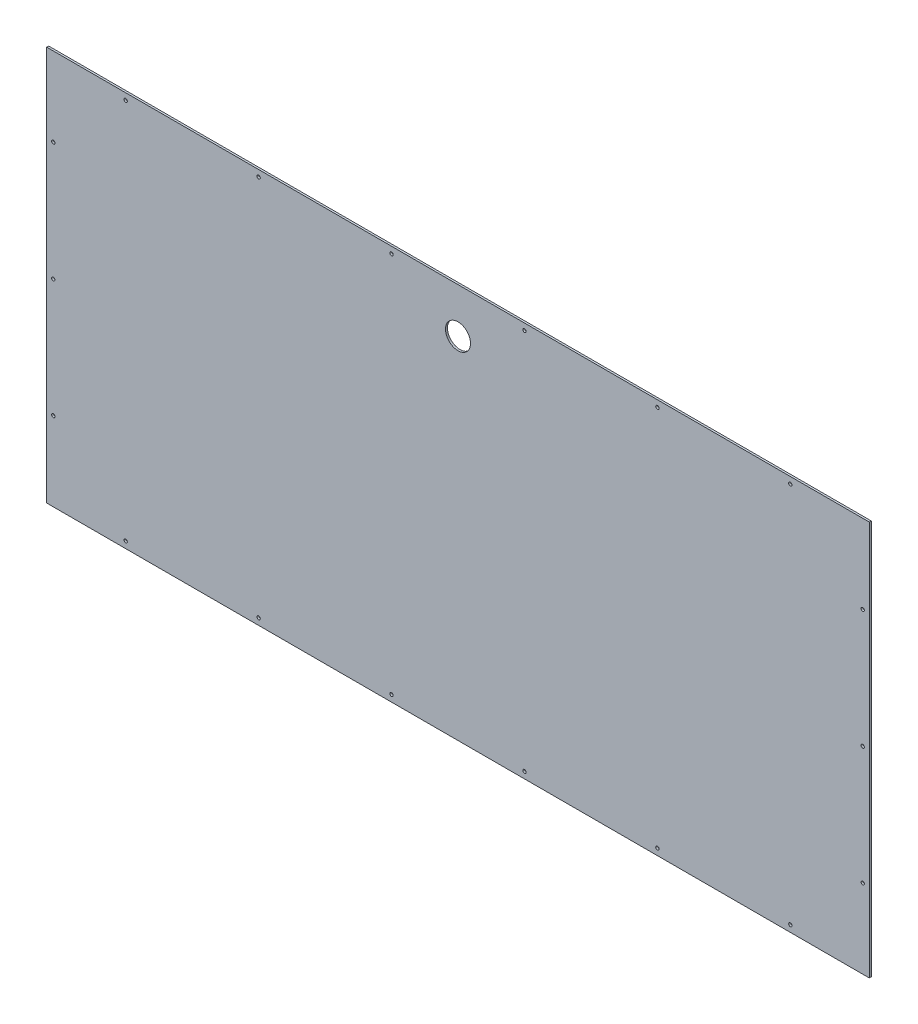
ISO-10303-21;
HEADER;
FILE_DESCRIPTION(('STEP AP214'),'2;1');
FILE_NAME('part.step','',(''),(''),'','','');
FILE_SCHEMA(('AUTOMOTIVE_DESIGN { 1 0 10303 214 1 1 1 1 }'));
ENDSEC;
DATA;
#1=APPLICATION_CONTEXT('core data for automotive mechanical design processes');
#2=APPLICATION_PROTOCOL_DEFINITION('international standard','automotive_design',2000,#1);
#3=PRODUCT_CONTEXT('',#1,'mechanical');
#4=PRODUCT('Part','Part','',(#3));
#5=PRODUCT_RELATED_PRODUCT_CATEGORY('part','',(#4));
#6=PRODUCT_DEFINITION_FORMATION('','',#4);
#7=PRODUCT_DEFINITION_CONTEXT('part definition',#1,'design');
#8=PRODUCT_DEFINITION('design','',#6,#7);
#9=PRODUCT_DEFINITION_SHAPE('','',#8);
#10=(LENGTH_UNIT() NAMED_UNIT(*) SI_UNIT(.MILLI.,.METRE.));
#11=(NAMED_UNIT(*) PLANE_ANGLE_UNIT() SI_UNIT($,.RADIAN.));
#12=(NAMED_UNIT(*) SI_UNIT($,.STERADIAN.) SOLID_ANGLE_UNIT());
#13=UNCERTAINTY_MEASURE_WITH_UNIT(LENGTH_MEASURE(1.E-05),#10,'distance_accuracy_value','');
#14=(GEOMETRIC_REPRESENTATION_CONTEXT(3) GLOBAL_UNCERTAINTY_ASSIGNED_CONTEXT((#13)) GLOBAL_UNIT_ASSIGNED_CONTEXT((#10,
#11,#12)) REPRESENTATION_CONTEXT('',''));
#15=CARTESIAN_POINT('',(0.,0.,0.));
#16=DIRECTION('',(0.,0.,1.));
#17=DIRECTION('',(1.,0.,0.));
#18=AXIS2_PLACEMENT_3D('',#15,#16,#17);
#19=CARTESIAN_POINT('',(0.,0.,3.));
#20=DIRECTION('',(0.,0.,1.));
#21=DIRECTION('',(1.,0.,0.));
#22=AXIS2_PLACEMENT_3D('',#19,#20,#21);
#23=PLANE('',#22);
#24=CARTESIAN_POINT('',(-505.,-290.000000000007,3.));
#25=DIRECTION('',(0.,0.,1.));
#26=DIRECTION('',(1.,0.,0.));
#27=AXIS2_PLACEMENT_3D('',#24,#25,#26);
#28=CIRCLE('',#27,2.55000000000005);
#29=CARTESIAN_POINT('',(-502.45,-290.000000000007,3.));
#30=VERTEX_POINT('',#29);
#31=EDGE_CURVE('E211',#30,#30,#28,.T.);
#32=ORIENTED_EDGE('',*,*,#31,.F.);
#33=EDGE_LOOP('',(#32));
#34=FACE_BOUND('',#33,.T.);
#35=CARTESIAN_POINT('',(615.000000000002,0.,3.));
#36=DIRECTION('',(0.,0.,1.));
#37=DIRECTION('',(1.,0.,0.));
#38=AXIS2_PLACEMENT_3D('',#35,#36,#37);
#39=CIRCLE('',#38,2.55000000000005);
#40=CARTESIAN_POINT('',(617.550000000002,0.,3.));
#41=VERTEX_POINT('',#40);
#42=EDGE_CURVE('E199',#41,#41,#39,.T.);
#43=ORIENTED_EDGE('',*,*,#42,.F.);
#44=EDGE_LOOP('',(#43));
#45=FACE_BOUND('',#44,.T.);
#46=CARTESIAN_POINT('',(-614.999999999997,-180.,3.));
#47=DIRECTION('',(0.,0.,1.));
#48=DIRECTION('',(1.,0.,0.));
#49=AXIS2_PLACEMENT_3D('',#46,#47,#48);
#50=CIRCLE('',#49,2.55000000000005);
#51=CARTESIAN_POINT('',(-612.449999999998,-180.,3.));
#52=VERTEX_POINT('',#51);
#53=EDGE_CURVE('E187',#52,#52,#50,.T.);
#54=ORIENTED_EDGE('',*,*,#53,.F.);
#55=EDGE_LOOP('',(#54));
#56=FACE_BOUND('',#55,.T.);
#57=CARTESIAN_POINT('',(-101.,-290.000000000004,3.));
#58=DIRECTION('',(0.,0.,1.));
#59=DIRECTION('',(1.,0.,0.));
#60=AXIS2_PLACEMENT_3D('',#57,#58,#59);
#61=CIRCLE('',#60,2.55);
#62=CARTESIAN_POINT('',(-98.4500000000002,-290.000000000004,3.));
#63=VERTEX_POINT('',#62);
#64=EDGE_CURVE('E175',#63,#63,#61,.T.);
#65=ORIENTED_EDGE('',*,*,#64,.F.);
#66=EDGE_LOOP('',(#65));
#67=FACE_BOUND('',#66,.T.);
#68=CARTESIAN_POINT('',(615.,180.,3.));
#69=DIRECTION('',(0.,0.,1.));
#70=DIRECTION('',(1.,0.,0.));
#71=AXIS2_PLACEMENT_3D('',#68,#69,#70);
#72=CIRCLE('',#71,2.55000000000005);
#73=CARTESIAN_POINT('',(617.55,180.,3.));
#74=VERTEX_POINT('',#73);
#75=EDGE_CURVE('E163',#74,#74,#72,.T.);
#76=ORIENTED_EDGE('',*,*,#75,.F.);
#77=EDGE_LOOP('',(#76));
#78=FACE_BOUND('',#77,.T.);
#79=CARTESIAN_POINT('',(303.,-290.000000000001,3.));
#80=DIRECTION('',(0.,0.,1.));
#81=DIRECTION('',(1.,0.,0.));
#82=AXIS2_PLACEMENT_3D('',#79,#80,#81);
#83=CIRCLE('',#82,2.55);
#84=CARTESIAN_POINT('',(305.55,-290.000000000001,3.));
#85=VERTEX_POINT('',#84);
#86=EDGE_CURVE('E151',#85,#85,#83,.T.);
#87=ORIENTED_EDGE('',*,*,#86,.F.);
#88=EDGE_LOOP('',(#87));
#89=FACE_BOUND('',#88,.T.);
#90=CARTESIAN_POINT('',(-303.,289.999999999995,3.));
#91=DIRECTION('',(0.,0.,1.));
#92=DIRECTION('',(1.,0.,0.));
#93=AXIS2_PLACEMENT_3D('',#90,#91,#92);
#94=CIRCLE('',#93,2.55);
#95=CARTESIAN_POINT('',(-300.45,289.999999999995,3.));
#96=VERTEX_POINT('',#95);
#97=EDGE_CURVE('E139',#96,#96,#94,.T.);
#98=ORIENTED_EDGE('',*,*,#97,.F.);
#99=EDGE_LOOP('',(#98));
#100=FACE_BOUND('',#99,.T.);
#101=CARTESIAN_POINT('',(505.,290.,3.));
#102=DIRECTION('',(0.,0.,1.));
#103=DIRECTION('',(1.,0.,0.));
#104=AXIS2_PLACEMENT_3D('',#101,#102,#103);
#105=CIRCLE('',#104,2.55000000000005);
#106=CARTESIAN_POINT('',(507.55,290.,3.));
#107=VERTEX_POINT('',#106);
#108=EDGE_CURVE('E127',#107,#107,#105,.T.);
#109=ORIENTED_EDGE('',*,*,#108,.F.);
#110=EDGE_LOOP('',(#109));
#111=FACE_BOUND('',#110,.T.);
#112=CARTESIAN_POINT('',(303.,289.999999999999,3.));
#113=DIRECTION('',(0.,0.,1.));
#114=DIRECTION('',(1.,0.,0.));
#115=AXIS2_PLACEMENT_3D('',#112,#113,#114);
#116=CIRCLE('',#115,2.55);
#117=CARTESIAN_POINT('',(305.55,289.999999999999,3.));
#118=VERTEX_POINT('',#117);
#119=EDGE_CURVE('E115',#118,#118,#116,.T.);
#120=ORIENTED_EDGE('',*,*,#119,.F.);
#121=EDGE_LOOP('',(#120));
#122=FACE_BOUND('',#121,.T.);
#123=DIRECTION('',(0.,1.,0.));
#124=VECTOR('',#123,1.);
#125=CARTESIAN_POINT('',(625.,300.,3.));
#126=LINE('',#125,#124);
#127=CARTESIAN_POINT('',(625.,-300.,3.));
#128=VERTEX_POINT('',#127);
#129=CARTESIAN_POINT('',(625.,300.,3.));
#130=VERTEX_POINT('',#129);
#131=EDGE_CURVE('E85',#128,#130,#126,.T.);
#132=ORIENTED_EDGE('',*,*,#131,.T.);
#133=DIRECTION('',(-1.,0.,0.));
#134=VECTOR('',#133,1.);
#135=CARTESIAN_POINT('',(-625.,300.,3.));
#136=LINE('',#135,#134);
#137=CARTESIAN_POINT('',(-625.,300.,3.));
#138=VERTEX_POINT('',#137);
#139=EDGE_CURVE('E80',#130,#138,#136,.T.);
#140=ORIENTED_EDGE('',*,*,#139,.T.);
#141=DIRECTION('',(0.,-1.,0.));
#142=VECTOR('',#141,1.);
#143=CARTESIAN_POINT('',(-625.,300.,3.));
#144=LINE('',#143,#142);
#145=CARTESIAN_POINT('',(-625.,-300.,3.));
#146=VERTEX_POINT('',#145);
#147=EDGE_CURVE('E83',#138,#146,#144,.T.);
#148=ORIENTED_EDGE('',*,*,#147,.T.);
#149=DIRECTION('',(1.,0.,0.));
#150=VECTOR('',#149,1.);
#151=CARTESIAN_POINT('',(-625.,-300.,3.));
#152=LINE('',#151,#150);
#153=EDGE_CURVE('E50',#146,#128,#152,.T.);
#154=ORIENTED_EDGE('',*,*,#153,.T.);
#155=EDGE_LOOP('',(#132,#140,#148,#154));
#156=FACE_BOUND('',#155,.T.);
#157=CARTESIAN_POINT('',(505.,-290.,3.));
#158=DIRECTION('',(0.,0.,1.));
#159=DIRECTION('',(1.,0.,0.));
#160=AXIS2_PLACEMENT_3D('',#157,#158,#159);
#161=CIRCLE('',#160,2.55000000000005);
#162=CARTESIAN_POINT('',(507.55,-290.,3.));
#163=VERTEX_POINT('',#162);
#164=EDGE_CURVE('E100',#163,#163,#161,.T.);
#165=ORIENTED_EDGE('',*,*,#164,.F.);
#166=EDGE_LOOP('',(#165));
#167=FACE_BOUND('',#166,.T.);
#168=CARTESIAN_POINT('',(101.,289.999999999997,3.));
#169=DIRECTION('',(0.,0.,1.));
#170=DIRECTION('',(1.,0.,0.));
#171=AXIS2_PLACEMENT_3D('',#168,#169,#170);
#172=CIRCLE('',#171,2.55);
#173=CARTESIAN_POINT('',(103.55,289.999999999997,3.));
#174=VERTEX_POINT('',#173);
#175=EDGE_CURVE('E121',#174,#174,#172,.T.);
#176=ORIENTED_EDGE('',*,*,#175,.F.);
#177=EDGE_LOOP('',(#176));
#178=FACE_BOUND('',#177,.T.);
#179=CARTESIAN_POINT('',(-101.,289.999999999996,3.));
#180=DIRECTION('',(0.,0.,1.));
#181=DIRECTION('',(1.,0.,0.));
#182=AXIS2_PLACEMENT_3D('',#179,#180,#181);
#183=CIRCLE('',#182,2.55);
#184=CARTESIAN_POINT('',(-98.4500000000004,289.999999999996,3.));
#185=VERTEX_POINT('',#184);
#186=EDGE_CURVE('E133',#185,#185,#183,.T.);
#187=ORIENTED_EDGE('',*,*,#186,.F.);
#188=EDGE_LOOP('',(#187));
#189=FACE_BOUND('',#188,.T.);
#190=CARTESIAN_POINT('',(-505.,289.999999999993,3.));
#191=DIRECTION('',(0.,0.,1.));
#192=DIRECTION('',(1.,0.,0.));
#193=AXIS2_PLACEMENT_3D('',#190,#191,#192);
#194=CIRCLE('',#193,2.55000000000005);
#195=CARTESIAN_POINT('',(-502.45,289.999999999993,3.));
#196=VERTEX_POINT('',#195);
#197=EDGE_CURVE('E145',#196,#196,#194,.T.);
#198=ORIENTED_EDGE('',*,*,#197,.F.);
#199=EDGE_LOOP('',(#198));
#200=FACE_BOUND('',#199,.T.);
#201=CARTESIAN_POINT('',(101.,-290.000000000003,3.));
#202=DIRECTION('',(0.,0.,1.));
#203=DIRECTION('',(1.,0.,0.));
#204=AXIS2_PLACEMENT_3D('',#201,#202,#203);
#205=CIRCLE('',#204,2.55);
#206=CARTESIAN_POINT('',(103.55,-290.000000000003,3.));
#207=VERTEX_POINT('',#206);
#208=EDGE_CURVE('E157',#207,#207,#205,.T.);
#209=ORIENTED_EDGE('',*,*,#208,.F.);
#210=EDGE_LOOP('',(#209));
#211=FACE_BOUND('',#210,.T.);
#212=CARTESIAN_POINT('',(-615.,180.,3.));
#213=DIRECTION('',(0.,0.,1.));
#214=DIRECTION('',(1.,0.,0.));
#215=AXIS2_PLACEMENT_3D('',#212,#213,#214);
#216=CIRCLE('',#215,2.55000000000005);
#217=CARTESIAN_POINT('',(-612.45,180.,3.));
#218=VERTEX_POINT('',#217);
#219=EDGE_CURVE('E169',#218,#218,#216,.T.);
#220=ORIENTED_EDGE('',*,*,#219,.F.);
#221=EDGE_LOOP('',(#220));
#222=FACE_BOUND('',#221,.T.);
#223=CARTESIAN_POINT('',(-614.999999999998,0.,3.));
#224=DIRECTION('',(0.,0.,1.));
#225=DIRECTION('',(1.,0.,0.));
#226=AXIS2_PLACEMENT_3D('',#223,#224,#225);
#227=CIRCLE('',#226,2.55000000000005);
#228=CARTESIAN_POINT('',(-612.449999999998,0.,3.));
#229=VERTEX_POINT('',#228);
#230=EDGE_CURVE('E181',#229,#229,#227,.T.);
#231=ORIENTED_EDGE('',*,*,#230,.F.);
#232=EDGE_LOOP('',(#231));
#233=FACE_BOUND('',#232,.T.);
#234=CARTESIAN_POINT('',(-303.,-290.000000000005,3.));
#235=DIRECTION('',(0.,0.,1.));
#236=DIRECTION('',(1.,0.,0.));
#237=AXIS2_PLACEMENT_3D('',#234,#235,#236);
#238=CIRCLE('',#237,2.55);
#239=CARTESIAN_POINT('',(-300.45,-290.000000000005,3.));
#240=VERTEX_POINT('',#239);
#241=EDGE_CURVE('E193',#240,#240,#238,.T.);
#242=ORIENTED_EDGE('',*,*,#241,.F.);
#243=EDGE_LOOP('',(#242));
#244=FACE_BOUND('',#243,.T.);
#245=CARTESIAN_POINT('',(615.000000000003,-180.,3.));
#246=DIRECTION('',(0.,0.,1.));
#247=DIRECTION('',(1.,0.,0.));
#248=AXIS2_PLACEMENT_3D('',#245,#246,#247);
#249=CIRCLE('',#248,2.55000000000005);
#250=CARTESIAN_POINT('',(617.550000000003,-180.,3.));
#251=VERTEX_POINT('',#250);
#252=EDGE_CURVE('E205',#251,#251,#249,.T.);
#253=ORIENTED_EDGE('',*,*,#252,.F.);
#254=EDGE_LOOP('',(#253));
#255=FACE_BOUND('',#254,.T.);
#256=CARTESIAN_POINT('',(-2.22044604925031E-13,232.,3.));
#257=DIRECTION('',(0.,0.,1.));
#258=DIRECTION('',(1.,0.,0.));
#259=AXIS2_PLACEMENT_3D('',#256,#257,#258);
#260=CIRCLE('',#259,19.);
#261=CARTESIAN_POINT('',(18.9999999999998,232.,3.));
#262=VERTEX_POINT('',#261);
#263=EDGE_CURVE('E217',#262,#262,#260,.T.);
#264=ORIENTED_EDGE('',*,*,#263,.F.);
#265=EDGE_LOOP('',(#264));
#266=FACE_BOUND('',#265,.T.);
#267=ADVANCED_FACE('F33',(#34,#45,#56,#67,#78,#89,#100,#111,#122,#156,#167,#178,#189,#200,#211,
#222,#233,#244,#255,#266),#23,.T.);
#268=CARTESIAN_POINT('',(0.,0.,0.));
#269=DIRECTION('',(0.,0.,1.));
#270=DIRECTION('',(1.,0.,0.));
#271=AXIS2_PLACEMENT_3D('',#268,#269,#270);
#272=PLANE('',#271);
#273=DIRECTION('',(0.,1.,0.));
#274=VECTOR('',#273,1.);
#275=CARTESIAN_POINT('',(625.,300.,0.));
#276=LINE('',#275,#274);
#277=CARTESIAN_POINT('',(625.,-300.,0.));
#278=VERTEX_POINT('',#277);
#279=CARTESIAN_POINT('',(625.,300.,0.));
#280=VERTEX_POINT('',#279);
#281=EDGE_CURVE('E97',#278,#280,#276,.T.);
#282=ORIENTED_EDGE('',*,*,#281,.F.);
#283=DIRECTION('',(1.,0.,0.));
#284=VECTOR('',#283,1.);
#285=CARTESIAN_POINT('',(-625.,-300.,0.));
#286=LINE('',#285,#284);
#287=CARTESIAN_POINT('',(-625.,-300.,0.));
#288=VERTEX_POINT('',#287);
#289=EDGE_CURVE('E73',#288,#278,#286,.T.);
#290=ORIENTED_EDGE('',*,*,#289,.F.);
#291=DIRECTION('',(0.,-1.,0.));
#292=VECTOR('',#291,1.);
#293=CARTESIAN_POINT('',(-625.,300.,0.));
#294=LINE('',#293,#292);
#295=CARTESIAN_POINT('',(-625.,300.,0.));
#296=VERTEX_POINT('',#295);
#297=EDGE_CURVE('E67',#296,#288,#294,.T.);
#298=ORIENTED_EDGE('',*,*,#297,.F.);
#299=DIRECTION('',(-1.,0.,0.));
#300=VECTOR('',#299,1.);
#301=CARTESIAN_POINT('',(-625.,300.,0.));
#302=LINE('',#301,#300);
#303=EDGE_CURVE('E89',#280,#296,#302,.T.);
#304=ORIENTED_EDGE('',*,*,#303,.F.);
#305=EDGE_LOOP('',(#282,#290,#298,#304));
#306=FACE_BOUND('',#305,.T.);
#307=CARTESIAN_POINT('',(505.,-290.,0.));
#308=DIRECTION('',(0.,0.,1.));
#309=DIRECTION('',(1.,0.,0.));
#310=AXIS2_PLACEMENT_3D('',#307,#308,#309);
#311=CIRCLE('',#310,2.55000000000005);
#312=CARTESIAN_POINT('',(507.55,-290.,0.));
#313=VERTEX_POINT('',#312);
#314=EDGE_CURVE('E112',#313,#313,#311,.T.);
#315=ORIENTED_EDGE('',*,*,#314,.T.);
#316=EDGE_LOOP('',(#315));
#317=FACE_BOUND('',#316,.T.);
#318=CARTESIAN_POINT('',(303.,289.999999999999,0.));
#319=DIRECTION('',(0.,0.,1.));
#320=DIRECTION('',(1.,0.,0.));
#321=AXIS2_PLACEMENT_3D('',#318,#319,#320);
#322=CIRCLE('',#321,2.55);
#323=CARTESIAN_POINT('',(305.55,289.999999999999,0.));
#324=VERTEX_POINT('',#323);
#325=EDGE_CURVE('E118',#324,#324,#322,.T.);
#326=ORIENTED_EDGE('',*,*,#325,.T.);
#327=EDGE_LOOP('',(#326));
#328=FACE_BOUND('',#327,.T.);
#329=CARTESIAN_POINT('',(101.,289.999999999997,0.));
#330=DIRECTION('',(0.,0.,1.));
#331=DIRECTION('',(1.,0.,0.));
#332=AXIS2_PLACEMENT_3D('',#329,#330,#331);
#333=CIRCLE('',#332,2.55);
#334=CARTESIAN_POINT('',(103.55,289.999999999997,0.));
#335=VERTEX_POINT('',#334);
#336=EDGE_CURVE('E124',#335,#335,#333,.T.);
#337=ORIENTED_EDGE('',*,*,#336,.T.);
#338=EDGE_LOOP('',(#337));
#339=FACE_BOUND('',#338,.T.);
#340=CARTESIAN_POINT('',(505.,290.,0.));
#341=DIRECTION('',(0.,0.,1.));
#342=DIRECTION('',(1.,0.,0.));
#343=AXIS2_PLACEMENT_3D('',#340,#341,#342);
#344=CIRCLE('',#343,2.55000000000005);
#345=CARTESIAN_POINT('',(507.55,290.,0.));
#346=VERTEX_POINT('',#345);
#347=EDGE_CURVE('E130',#346,#346,#344,.T.);
#348=ORIENTED_EDGE('',*,*,#347,.T.);
#349=EDGE_LOOP('',(#348));
#350=FACE_BOUND('',#349,.T.);
#351=CARTESIAN_POINT('',(-101.,289.999999999996,0.));
#352=DIRECTION('',(0.,0.,1.));
#353=DIRECTION('',(1.,0.,0.));
#354=AXIS2_PLACEMENT_3D('',#351,#352,#353);
#355=CIRCLE('',#354,2.55);
#356=CARTESIAN_POINT('',(-98.4500000000004,289.999999999996,0.));
#357=VERTEX_POINT('',#356);
#358=EDGE_CURVE('E136',#357,#357,#355,.T.);
#359=ORIENTED_EDGE('',*,*,#358,.T.);
#360=EDGE_LOOP('',(#359));
#361=FACE_BOUND('',#360,.T.);
#362=CARTESIAN_POINT('',(-303.,289.999999999995,0.));
#363=DIRECTION('',(0.,0.,1.));
#364=DIRECTION('',(1.,0.,0.));
#365=AXIS2_PLACEMENT_3D('',#362,#363,#364);
#366=CIRCLE('',#365,2.55);
#367=CARTESIAN_POINT('',(-300.45,289.999999999995,0.));
#368=VERTEX_POINT('',#367);
#369=EDGE_CURVE('E142',#368,#368,#366,.T.);
#370=ORIENTED_EDGE('',*,*,#369,.T.);
#371=EDGE_LOOP('',(#370));
#372=FACE_BOUND('',#371,.T.);
#373=CARTESIAN_POINT('',(-505.,289.999999999993,0.));
#374=DIRECTION('',(0.,0.,1.));
#375=DIRECTION('',(1.,0.,0.));
#376=AXIS2_PLACEMENT_3D('',#373,#374,#375);
#377=CIRCLE('',#376,2.55000000000005);
#378=CARTESIAN_POINT('',(-502.45,289.999999999993,0.));
#379=VERTEX_POINT('',#378);
#380=EDGE_CURVE('E148',#379,#379,#377,.T.);
#381=ORIENTED_EDGE('',*,*,#380,.T.);
#382=EDGE_LOOP('',(#381));
#383=FACE_BOUND('',#382,.T.);
#384=CARTESIAN_POINT('',(303.,-290.000000000001,0.));
#385=DIRECTION('',(0.,0.,1.));
#386=DIRECTION('',(1.,0.,0.));
#387=AXIS2_PLACEMENT_3D('',#384,#385,#386);
#388=CIRCLE('',#387,2.55);
#389=CARTESIAN_POINT('',(305.55,-290.000000000001,0.));
#390=VERTEX_POINT('',#389);
#391=EDGE_CURVE('E154',#390,#390,#388,.T.);
#392=ORIENTED_EDGE('',*,*,#391,.T.);
#393=EDGE_LOOP('',(#392));
#394=FACE_BOUND('',#393,.T.);
#395=CARTESIAN_POINT('',(101.,-290.000000000003,0.));
#396=DIRECTION('',(0.,0.,1.));
#397=DIRECTION('',(1.,0.,0.));
#398=AXIS2_PLACEMENT_3D('',#395,#396,#397);
#399=CIRCLE('',#398,2.55);
#400=CARTESIAN_POINT('',(103.55,-290.000000000003,0.));
#401=VERTEX_POINT('',#400);
#402=EDGE_CURVE('E160',#401,#401,#399,.T.);
#403=ORIENTED_EDGE('',*,*,#402,.T.);
#404=EDGE_LOOP('',(#403));
#405=FACE_BOUND('',#404,.T.);
#406=CARTESIAN_POINT('',(615.,180.,0.));
#407=DIRECTION('',(0.,0.,1.));
#408=DIRECTION('',(1.,0.,0.));
#409=AXIS2_PLACEMENT_3D('',#406,#407,#408);
#410=CIRCLE('',#409,2.55000000000005);
#411=CARTESIAN_POINT('',(617.55,180.,0.));
#412=VERTEX_POINT('',#411);
#413=EDGE_CURVE('E166',#412,#412,#410,.T.);
#414=ORIENTED_EDGE('',*,*,#413,.T.);
#415=EDGE_LOOP('',(#414));
#416=FACE_BOUND('',#415,.T.);
#417=CARTESIAN_POINT('',(-615.,180.,0.));
#418=DIRECTION('',(0.,0.,1.));
#419=DIRECTION('',(1.,0.,0.));
#420=AXIS2_PLACEMENT_3D('',#417,#418,#419);
#421=CIRCLE('',#420,2.55000000000005);
#422=CARTESIAN_POINT('',(-612.45,180.,0.));
#423=VERTEX_POINT('',#422);
#424=EDGE_CURVE('E172',#423,#423,#421,.T.);
#425=ORIENTED_EDGE('',*,*,#424,.T.);
#426=EDGE_LOOP('',(#425));
#427=FACE_BOUND('',#426,.T.);
#428=CARTESIAN_POINT('',(-101.,-290.000000000004,0.));
#429=DIRECTION('',(0.,0.,1.));
#430=DIRECTION('',(1.,0.,0.));
#431=AXIS2_PLACEMENT_3D('',#428,#429,#430);
#432=CIRCLE('',#431,2.55);
#433=CARTESIAN_POINT('',(-98.4500000000002,-290.000000000004,0.));
#434=VERTEX_POINT('',#433);
#435=EDGE_CURVE('E178',#434,#434,#432,.T.);
#436=ORIENTED_EDGE('',*,*,#435,.T.);
#437=EDGE_LOOP('',(#436));
#438=FACE_BOUND('',#437,.T.);
#439=CARTESIAN_POINT('',(-614.999999999998,0.,0.));
#440=DIRECTION('',(0.,0.,1.));
#441=DIRECTION('',(1.,0.,0.));
#442=AXIS2_PLACEMENT_3D('',#439,#440,#441);
#443=CIRCLE('',#442,2.55000000000005);
#444=CARTESIAN_POINT('',(-612.449999999998,0.,0.));
#445=VERTEX_POINT('',#444);
#446=EDGE_CURVE('E184',#445,#445,#443,.T.);
#447=ORIENTED_EDGE('',*,*,#446,.T.);
#448=EDGE_LOOP('',(#447));
#449=FACE_BOUND('',#448,.T.);
#450=CARTESIAN_POINT('',(-614.999999999997,-180.,0.));
#451=DIRECTION('',(0.,0.,1.));
#452=DIRECTION('',(1.,0.,0.));
#453=AXIS2_PLACEMENT_3D('',#450,#451,#452);
#454=CIRCLE('',#453,2.55000000000005);
#455=CARTESIAN_POINT('',(-612.449999999998,-180.,0.));
#456=VERTEX_POINT('',#455);
#457=EDGE_CURVE('E190',#456,#456,#454,.T.);
#458=ORIENTED_EDGE('',*,*,#457,.T.);
#459=EDGE_LOOP('',(#458));
#460=FACE_BOUND('',#459,.T.);
#461=CARTESIAN_POINT('',(-303.,-290.000000000005,0.));
#462=DIRECTION('',(0.,0.,1.));
#463=DIRECTION('',(1.,0.,0.));
#464=AXIS2_PLACEMENT_3D('',#461,#462,#463);
#465=CIRCLE('',#464,2.55);
#466=CARTESIAN_POINT('',(-300.45,-290.000000000005,0.));
#467=VERTEX_POINT('',#466);
#468=EDGE_CURVE('E196',#467,#467,#465,.T.);
#469=ORIENTED_EDGE('',*,*,#468,.T.);
#470=EDGE_LOOP('',(#469));
#471=FACE_BOUND('',#470,.T.);
#472=CARTESIAN_POINT('',(615.000000000002,0.,0.));
#473=DIRECTION('',(0.,0.,1.));
#474=DIRECTION('',(1.,0.,0.));
#475=AXIS2_PLACEMENT_3D('',#472,#473,#474);
#476=CIRCLE('',#475,2.55000000000005);
#477=CARTESIAN_POINT('',(617.550000000002,0.,0.));
#478=VERTEX_POINT('',#477);
#479=EDGE_CURVE('E202',#478,#478,#476,.T.);
#480=ORIENTED_EDGE('',*,*,#479,.T.);
#481=EDGE_LOOP('',(#480));
#482=FACE_BOUND('',#481,.T.);
#483=CARTESIAN_POINT('',(615.000000000003,-180.,0.));
#484=DIRECTION('',(0.,0.,1.));
#485=DIRECTION('',(1.,0.,0.));
#486=AXIS2_PLACEMENT_3D('',#483,#484,#485);
#487=CIRCLE('',#486,2.55000000000005);
#488=CARTESIAN_POINT('',(617.550000000003,-180.,0.));
#489=VERTEX_POINT('',#488);
#490=EDGE_CURVE('E208',#489,#489,#487,.T.);
#491=ORIENTED_EDGE('',*,*,#490,.T.);
#492=EDGE_LOOP('',(#491));
#493=FACE_BOUND('',#492,.T.);
#494=CARTESIAN_POINT('',(-505.,-290.000000000007,0.));
#495=DIRECTION('',(0.,0.,1.));
#496=DIRECTION('',(1.,0.,0.));
#497=AXIS2_PLACEMENT_3D('',#494,#495,#496);
#498=CIRCLE('',#497,2.55000000000005);
#499=CARTESIAN_POINT('',(-502.45,-290.000000000007,0.));
#500=VERTEX_POINT('',#499);
#501=EDGE_CURVE('E214',#500,#500,#498,.T.);
#502=ORIENTED_EDGE('',*,*,#501,.T.);
#503=EDGE_LOOP('',(#502));
#504=FACE_BOUND('',#503,.T.);
#505=CARTESIAN_POINT('',(-2.22044604925031E-13,232.,0.));
#506=DIRECTION('',(0.,0.,1.));
#507=DIRECTION('',(1.,0.,0.));
#508=AXIS2_PLACEMENT_3D('',#505,#506,#507);
#509=CIRCLE('',#508,19.);
#510=CARTESIAN_POINT('',(18.9999999999998,232.,0.));
#511=VERTEX_POINT('',#510);
#512=EDGE_CURVE('E220',#511,#511,#509,.T.);
#513=ORIENTED_EDGE('',*,*,#512,.T.);
#514=EDGE_LOOP('',(#513));
#515=FACE_BOUND('',#514,.T.);
#516=ADVANCED_FACE('F108',(#306,#317,#328,#339,#350,#361,#372,#383,#394,#405,#416,#427,#438,
#449,#460,#471,#482,#493,#504,#515),#272,.F.);
#517=CARTESIAN_POINT('',(625.,300.,3.));
#518=DIRECTION('',(-1.,0.,0.));
#519=DIRECTION('',(0.,0.,1.));
#520=AXIS2_PLACEMENT_3D('',#517,#518,#519);
#521=PLANE('',#520);
#522=ORIENTED_EDGE('',*,*,#281,.T.);
#523=DIRECTION('',(0.,0.,-1.));
#524=VECTOR('',#523,1.);
#525=CARTESIAN_POINT('',(625.,300.,3.));
#526=LINE('',#525,#524);
#527=EDGE_CURVE('E11',#130,#280,#526,.T.);
#528=ORIENTED_EDGE('',*,*,#527,.F.);
#529=ORIENTED_EDGE('',*,*,#131,.F.);
#530=DIRECTION('',(0.,0.,-1.));
#531=VECTOR('',#530,1.);
#532=CARTESIAN_POINT('',(625.,-300.,3.));
#533=LINE('',#532,#531);
#534=EDGE_CURVE('E93',#128,#278,#533,.T.);
#535=ORIENTED_EDGE('',*,*,#534,.T.);
#536=EDGE_LOOP('',(#522,#528,#529,#535));
#537=FACE_BOUND('',#536,.T.);
#538=ADVANCED_FACE('F35',(#537),#521,.F.);
#539=CARTESIAN_POINT('',(-625.,300.,3.));
#540=DIRECTION('',(0.,-1.,0.));
#541=DIRECTION('',(0.,0.,-1.));
#542=AXIS2_PLACEMENT_3D('',#539,#540,#541);
#543=PLANE('',#542);
#544=ORIENTED_EDGE('',*,*,#303,.T.);
#545=DIRECTION('',(0.,0.,-1.));
#546=VECTOR('',#545,1.);
#547=CARTESIAN_POINT('',(-625.,300.,3.));
#548=LINE('',#547,#546);
#549=EDGE_CURVE('E42',#138,#296,#548,.T.);
#550=ORIENTED_EDGE('',*,*,#549,.F.);
#551=ORIENTED_EDGE('',*,*,#139,.F.);
#552=ORIENTED_EDGE('',*,*,#527,.T.);
#553=EDGE_LOOP('',(#544,#550,#551,#552));
#554=FACE_BOUND('',#553,.T.);
#555=ADVANCED_FACE('F88',(#554),#543,.F.);
#556=CARTESIAN_POINT('',(-625.,300.,3.));
#557=DIRECTION('',(1.,0.,0.));
#558=DIRECTION('',(0.,1.,0.));
#559=AXIS2_PLACEMENT_3D('',#556,#557,#558);
#560=PLANE('',#559);
#561=ORIENTED_EDGE('',*,*,#297,.T.);
#562=DIRECTION('',(0.,0.,-1.));
#563=VECTOR('',#562,1.);
#564=CARTESIAN_POINT('',(-625.,-300.,3.));
#565=LINE('',#564,#563);
#566=EDGE_CURVE('E90',#146,#288,#565,.T.);
#567=ORIENTED_EDGE('',*,*,#566,.F.);
#568=ORIENTED_EDGE('',*,*,#147,.F.);
#569=ORIENTED_EDGE('',*,*,#549,.T.);
#570=EDGE_LOOP('',(#561,#567,#568,#569));
#571=FACE_BOUND('',#570,.T.);
#572=ADVANCED_FACE('F91',(#571),#560,.F.);
#573=CARTESIAN_POINT('',(-625.,-300.,3.));
#574=DIRECTION('',(0.,1.,0.));
#575=DIRECTION('',(0.,0.,1.));
#576=AXIS2_PLACEMENT_3D('',#573,#574,#575);
#577=PLANE('',#576);
#578=ORIENTED_EDGE('',*,*,#289,.T.);
#579=ORIENTED_EDGE('',*,*,#534,.F.);
#580=ORIENTED_EDGE('',*,*,#153,.F.);
#581=ORIENTED_EDGE('',*,*,#566,.T.);
#582=EDGE_LOOP('',(#578,#579,#580,#581));
#583=FACE_BOUND('',#582,.T.);
#584=ADVANCED_FACE('F105',(#583),#577,.F.);
#585=CARTESIAN_POINT('',(505.,-290.,3.));
#586=DIRECTION('',(0.,0.,-1.));
#587=DIRECTION('',(-1.,0.,0.));
#588=AXIS2_PLACEMENT_3D('',#585,#586,#587);
#589=CYLINDRICAL_SURFACE('',#588,2.55000000000005);
#590=ORIENTED_EDGE('',*,*,#164,.T.);
#591=EDGE_LOOP('',(#590));
#592=FACE_BOUND('',#591,.T.);
#593=ORIENTED_EDGE('',*,*,#314,.F.);
#594=EDGE_LOOP('',(#593));
#595=FACE_BOUND('',#594,.T.);
#596=ADVANCED_FACE('F239',(#592,#595),#589,.F.);
#597=CARTESIAN_POINT('',(303.,289.999999999999,3.));
#598=DIRECTION('',(0.,0.,-1.));
#599=DIRECTION('',(-1.,0.,0.));
#600=AXIS2_PLACEMENT_3D('',#597,#598,#599);
#601=CYLINDRICAL_SURFACE('',#600,2.55);
#602=ORIENTED_EDGE('',*,*,#119,.T.);
#603=EDGE_LOOP('',(#602));
#604=FACE_BOUND('',#603,.T.);
#605=ORIENTED_EDGE('',*,*,#325,.F.);
#606=EDGE_LOOP('',(#605));
#607=FACE_BOUND('',#606,.T.);
#608=ADVANCED_FACE('F285',(#604,#607),#601,.F.);
#609=CARTESIAN_POINT('',(101.,289.999999999997,3.));
#610=DIRECTION('',(0.,0.,-1.));
#611=DIRECTION('',(-1.,0.,0.));
#612=AXIS2_PLACEMENT_3D('',#609,#610,#611);
#613=CYLINDRICAL_SURFACE('',#612,2.55);
#614=ORIENTED_EDGE('',*,*,#175,.T.);
#615=EDGE_LOOP('',(#614));
#616=FACE_BOUND('',#615,.T.);
#617=ORIENTED_EDGE('',*,*,#336,.F.);
#618=EDGE_LOOP('',(#617));
#619=FACE_BOUND('',#618,.T.);
#620=ADVANCED_FACE('F293',(#616,#619),#613,.F.);
#621=CARTESIAN_POINT('',(505.,290.,3.));
#622=DIRECTION('',(0.,0.,-1.));
#623=DIRECTION('',(-1.,0.,0.));
#624=AXIS2_PLACEMENT_3D('',#621,#622,#623);
#625=CYLINDRICAL_SURFACE('',#624,2.55000000000005);
#626=ORIENTED_EDGE('',*,*,#108,.T.);
#627=EDGE_LOOP('',(#626));
#628=FACE_BOUND('',#627,.T.);
#629=ORIENTED_EDGE('',*,*,#347,.F.);
#630=EDGE_LOOP('',(#629));
#631=FACE_BOUND('',#630,.T.);
#632=ADVANCED_FACE('F301',(#628,#631),#625,.F.);
#633=CARTESIAN_POINT('',(-101.,289.999999999996,3.));
#634=DIRECTION('',(0.,0.,-1.));
#635=DIRECTION('',(-1.,0.,0.));
#636=AXIS2_PLACEMENT_3D('',#633,#634,#635);
#637=CYLINDRICAL_SURFACE('',#636,2.55);
#638=ORIENTED_EDGE('',*,*,#186,.T.);
#639=EDGE_LOOP('',(#638));
#640=FACE_BOUND('',#639,.T.);
#641=ORIENTED_EDGE('',*,*,#358,.F.);
#642=EDGE_LOOP('',(#641));
#643=FACE_BOUND('',#642,.T.);
#644=ADVANCED_FACE('F310',(#640,#643),#637,.F.);
#645=CARTESIAN_POINT('',(-303.,289.999999999995,3.));
#646=DIRECTION('',(0.,0.,-1.));
#647=DIRECTION('',(-1.,0.,0.));
#648=AXIS2_PLACEMENT_3D('',#645,#646,#647);
#649=CYLINDRICAL_SURFACE('',#648,2.55);
#650=ORIENTED_EDGE('',*,*,#97,.T.);
#651=EDGE_LOOP('',(#650));
#652=FACE_BOUND('',#651,.T.);
#653=ORIENTED_EDGE('',*,*,#369,.F.);
#654=EDGE_LOOP('',(#653));
#655=FACE_BOUND('',#654,.T.);
#656=ADVANCED_FACE('F319',(#652,#655),#649,.F.);
#657=CARTESIAN_POINT('',(-505.,289.999999999993,3.));
#658=DIRECTION('',(0.,0.,-1.));
#659=DIRECTION('',(-1.,0.,0.));
#660=AXIS2_PLACEMENT_3D('',#657,#658,#659);
#661=CYLINDRICAL_SURFACE('',#660,2.55000000000005);
#662=ORIENTED_EDGE('',*,*,#197,.T.);
#663=EDGE_LOOP('',(#662));
#664=FACE_BOUND('',#663,.T.);
#665=ORIENTED_EDGE('',*,*,#380,.F.);
#666=EDGE_LOOP('',(#665));
#667=FACE_BOUND('',#666,.T.);
#668=ADVANCED_FACE('F328',(#664,#667),#661,.F.);
#669=CARTESIAN_POINT('',(303.,-290.000000000001,3.));
#670=DIRECTION('',(0.,0.,-1.));
#671=DIRECTION('',(-1.,0.,0.));
#672=AXIS2_PLACEMENT_3D('',#669,#670,#671);
#673=CYLINDRICAL_SURFACE('',#672,2.55);
#674=ORIENTED_EDGE('',*,*,#86,.T.);
#675=EDGE_LOOP('',(#674));
#676=FACE_BOUND('',#675,.T.);
#677=ORIENTED_EDGE('',*,*,#391,.F.);
#678=EDGE_LOOP('',(#677));
#679=FACE_BOUND('',#678,.T.);
#680=ADVANCED_FACE('F337',(#676,#679),#673,.F.);
#681=CARTESIAN_POINT('',(101.,-290.000000000003,3.));
#682=DIRECTION('',(0.,0.,-1.));
#683=DIRECTION('',(-1.,0.,0.));
#684=AXIS2_PLACEMENT_3D('',#681,#682,#683);
#685=CYLINDRICAL_SURFACE('',#684,2.55);
#686=ORIENTED_EDGE('',*,*,#208,.T.);
#687=EDGE_LOOP('',(#686));
#688=FACE_BOUND('',#687,.T.);
#689=ORIENTED_EDGE('',*,*,#402,.F.);
#690=EDGE_LOOP('',(#689));
#691=FACE_BOUND('',#690,.T.);
#692=ADVANCED_FACE('F346',(#688,#691),#685,.F.);
#693=CARTESIAN_POINT('',(615.,180.,3.));
#694=DIRECTION('',(0.,0.,-1.));
#695=DIRECTION('',(-1.,0.,0.));
#696=AXIS2_PLACEMENT_3D('',#693,#694,#695);
#697=CYLINDRICAL_SURFACE('',#696,2.55000000000005);
#698=ORIENTED_EDGE('',*,*,#75,.T.);
#699=EDGE_LOOP('',(#698));
#700=FACE_BOUND('',#699,.T.);
#701=ORIENTED_EDGE('',*,*,#413,.F.);
#702=EDGE_LOOP('',(#701));
#703=FACE_BOUND('',#702,.T.);
#704=ADVANCED_FACE('F355',(#700,#703),#697,.F.);
#705=CARTESIAN_POINT('',(-615.,180.,3.));
#706=DIRECTION('',(0.,0.,-1.));
#707=DIRECTION('',(-1.,0.,0.));
#708=AXIS2_PLACEMENT_3D('',#705,#706,#707);
#709=CYLINDRICAL_SURFACE('',#708,2.55000000000005);
#710=ORIENTED_EDGE('',*,*,#219,.T.);
#711=EDGE_LOOP('',(#710));
#712=FACE_BOUND('',#711,.T.);
#713=ORIENTED_EDGE('',*,*,#424,.F.);
#714=EDGE_LOOP('',(#713));
#715=FACE_BOUND('',#714,.T.);
#716=ADVANCED_FACE('F364',(#712,#715),#709,.F.);
#717=CARTESIAN_POINT('',(-101.,-290.000000000004,3.));
#718=DIRECTION('',(0.,0.,-1.));
#719=DIRECTION('',(-1.,0.,0.));
#720=AXIS2_PLACEMENT_3D('',#717,#718,#719);
#721=CYLINDRICAL_SURFACE('',#720,2.55);
#722=ORIENTED_EDGE('',*,*,#64,.T.);
#723=EDGE_LOOP('',(#722));
#724=FACE_BOUND('',#723,.T.);
#725=ORIENTED_EDGE('',*,*,#435,.F.);
#726=EDGE_LOOP('',(#725));
#727=FACE_BOUND('',#726,.T.);
#728=ADVANCED_FACE('F373',(#724,#727),#721,.F.);
#729=CARTESIAN_POINT('',(-614.999999999998,0.,3.));
#730=DIRECTION('',(0.,0.,-1.));
#731=DIRECTION('',(-1.,0.,0.));
#732=AXIS2_PLACEMENT_3D('',#729,#730,#731);
#733=CYLINDRICAL_SURFACE('',#732,2.55000000000005);
#734=ORIENTED_EDGE('',*,*,#230,.T.);
#735=EDGE_LOOP('',(#734));
#736=FACE_BOUND('',#735,.T.);
#737=ORIENTED_EDGE('',*,*,#446,.F.);
#738=EDGE_LOOP('',(#737));
#739=FACE_BOUND('',#738,.T.);
#740=ADVANCED_FACE('F382',(#736,#739),#733,.F.);
#741=CARTESIAN_POINT('',(-614.999999999997,-180.,3.));
#742=DIRECTION('',(0.,0.,-1.));
#743=DIRECTION('',(-1.,0.,0.));
#744=AXIS2_PLACEMENT_3D('',#741,#742,#743);
#745=CYLINDRICAL_SURFACE('',#744,2.55000000000005);
#746=ORIENTED_EDGE('',*,*,#53,.T.);
#747=EDGE_LOOP('',(#746));
#748=FACE_BOUND('',#747,.T.);
#749=ORIENTED_EDGE('',*,*,#457,.F.);
#750=EDGE_LOOP('',(#749));
#751=FACE_BOUND('',#750,.T.);
#752=ADVANCED_FACE('F391',(#748,#751),#745,.F.);
#753=CARTESIAN_POINT('',(-303.,-290.000000000005,3.));
#754=DIRECTION('',(0.,0.,-1.));
#755=DIRECTION('',(-1.,0.,0.));
#756=AXIS2_PLACEMENT_3D('',#753,#754,#755);
#757=CYLINDRICAL_SURFACE('',#756,2.55);
#758=ORIENTED_EDGE('',*,*,#241,.T.);
#759=EDGE_LOOP('',(#758));
#760=FACE_BOUND('',#759,.T.);
#761=ORIENTED_EDGE('',*,*,#468,.F.);
#762=EDGE_LOOP('',(#761));
#763=FACE_BOUND('',#762,.T.);
#764=ADVANCED_FACE('F400',(#760,#763),#757,.F.);
#765=CARTESIAN_POINT('',(615.000000000002,0.,3.));
#766=DIRECTION('',(0.,0.,-1.));
#767=DIRECTION('',(-1.,0.,0.));
#768=AXIS2_PLACEMENT_3D('',#765,#766,#767);
#769=CYLINDRICAL_SURFACE('',#768,2.55000000000005);
#770=ORIENTED_EDGE('',*,*,#42,.T.);
#771=EDGE_LOOP('',(#770));
#772=FACE_BOUND('',#771,.T.);
#773=ORIENTED_EDGE('',*,*,#479,.F.);
#774=EDGE_LOOP('',(#773));
#775=FACE_BOUND('',#774,.T.);
#776=ADVANCED_FACE('F409',(#772,#775),#769,.F.);
#777=CARTESIAN_POINT('',(615.000000000003,-180.,3.));
#778=DIRECTION('',(0.,0.,-1.));
#779=DIRECTION('',(-1.,0.,0.));
#780=AXIS2_PLACEMENT_3D('',#777,#778,#779);
#781=CYLINDRICAL_SURFACE('',#780,2.55000000000005);
#782=ORIENTED_EDGE('',*,*,#252,.T.);
#783=EDGE_LOOP('',(#782));
#784=FACE_BOUND('',#783,.T.);
#785=ORIENTED_EDGE('',*,*,#490,.F.);
#786=EDGE_LOOP('',(#785));
#787=FACE_BOUND('',#786,.T.);
#788=ADVANCED_FACE('F418',(#784,#787),#781,.F.);
#789=CARTESIAN_POINT('',(-505.,-290.000000000007,3.));
#790=DIRECTION('',(0.,0.,-1.));
#791=DIRECTION('',(-1.,0.,0.));
#792=AXIS2_PLACEMENT_3D('',#789,#790,#791);
#793=CYLINDRICAL_SURFACE('',#792,2.55000000000005);
#794=ORIENTED_EDGE('',*,*,#31,.T.);
#795=EDGE_LOOP('',(#794));
#796=FACE_BOUND('',#795,.T.);
#797=ORIENTED_EDGE('',*,*,#501,.F.);
#798=EDGE_LOOP('',(#797));
#799=FACE_BOUND('',#798,.T.);
#800=ADVANCED_FACE('F427',(#796,#799),#793,.F.);
#801=CARTESIAN_POINT('',(-2.22044604925031E-13,232.,3.));
#802=DIRECTION('',(0.,0.,-1.));
#803=DIRECTION('',(-1.,0.,0.));
#804=AXIS2_PLACEMENT_3D('',#801,#802,#803);
#805=CYLINDRICAL_SURFACE('',#804,19.);
#806=ORIENTED_EDGE('',*,*,#263,.T.);
#807=EDGE_LOOP('',(#806));
#808=FACE_BOUND('',#807,.T.);
#809=ORIENTED_EDGE('',*,*,#512,.F.);
#810=EDGE_LOOP('',(#809));
#811=FACE_BOUND('',#810,.T.);
#812=ADVANCED_FACE('F226',(#808,#811),#805,.F.);
#813=CLOSED_SHELL('',(#267,#516,#538,#555,#572,#584,#596,#608,#620,#632,#644,#656,#668,#680,
#692,#704,#716,#728,#740,#752,#764,#776,#788,#800,#812));
#814=MANIFOLD_SOLID_BREP('B2',#813);
#815=ADVANCED_BREP_SHAPE_REPRESENTATION('',(#18,#814),#14);
#816=SHAPE_DEFINITION_REPRESENTATION(#9,#815);
ENDSEC;
END-ISO-10303-21;
